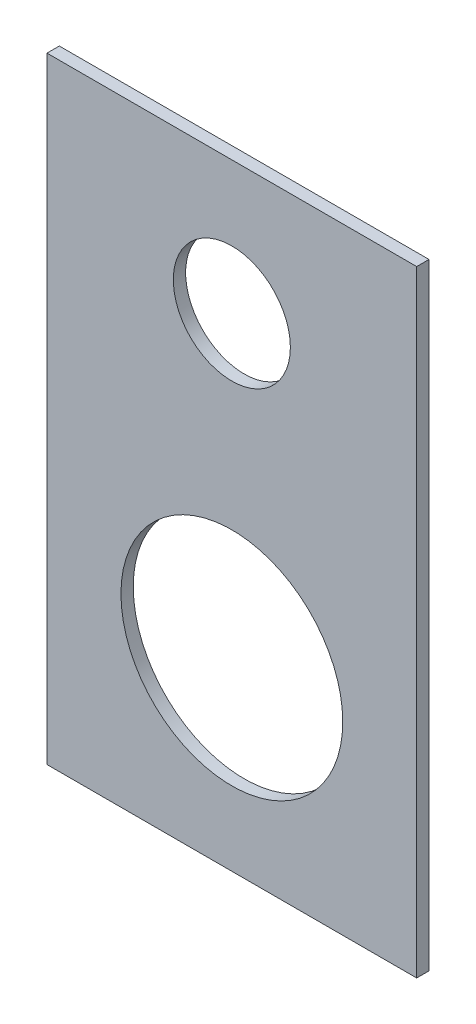
ISO-10303-21;
HEADER;
FILE_DESCRIPTION(('STEP AP214'),'2;1');
FILE_NAME('part.step','',(''),(''),'','','');
FILE_SCHEMA(('AUTOMOTIVE_DESIGN { 1 0 10303 214 1 1 1 1 }'));
ENDSEC;
DATA;
#1=APPLICATION_CONTEXT('core data for automotive mechanical design processes');
#2=APPLICATION_PROTOCOL_DEFINITION('international standard','automotive_design',2000,#1);
#3=PRODUCT_CONTEXT('',#1,'mechanical');
#4=PRODUCT('Part','Part','',(#3));
#5=PRODUCT_RELATED_PRODUCT_CATEGORY('part','',(#4));
#6=PRODUCT_DEFINITION_FORMATION('','',#4);
#7=PRODUCT_DEFINITION_CONTEXT('part definition',#1,'design');
#8=PRODUCT_DEFINITION('design','',#6,#7);
#9=PRODUCT_DEFINITION_SHAPE('','',#8);
#10=(LENGTH_UNIT() NAMED_UNIT(*) SI_UNIT(.MILLI.,.METRE.));
#11=(NAMED_UNIT(*) PLANE_ANGLE_UNIT() SI_UNIT($,.RADIAN.));
#12=(NAMED_UNIT(*) SI_UNIT($,.STERADIAN.) SOLID_ANGLE_UNIT());
#13=UNCERTAINTY_MEASURE_WITH_UNIT(LENGTH_MEASURE(1.E-05),#10,'distance_accuracy_value','');
#14=(GEOMETRIC_REPRESENTATION_CONTEXT(3) GLOBAL_UNCERTAINTY_ASSIGNED_CONTEXT((#13)) GLOBAL_UNIT_ASSIGNED_CONTEXT((#10,
#11,#12)) REPRESENTATION_CONTEXT('',''));
#15=CARTESIAN_POINT('',(0.,0.,0.));
#16=DIRECTION('',(0.,0.,1.));
#17=DIRECTION('',(1.,0.,0.));
#18=AXIS2_PLACEMENT_3D('',#15,#16,#17);
#19=CARTESIAN_POINT('',(0.,0.,-10.));
#20=DIRECTION('',(-1.,0.,0.));
#21=DIRECTION('',(0.,-1.,0.));
#22=AXIS2_PLACEMENT_3D('',#19,#20,#21);
#23=PLANE('',#22);
#24=DIRECTION('',(0.,-1.,0.));
#25=VECTOR('',#24,1.);
#26=CARTESIAN_POINT('',(0.,0.,0.));
#27=LINE('',#26,#25);
#28=CARTESIAN_POINT('',(-1.20207153456121E-13,500.,0.));
#29=VERTEX_POINT('',#28);
#30=CARTESIAN_POINT('',(0.,0.,0.));
#31=VERTEX_POINT('',#30);
#32=EDGE_CURVE('E96',#29,#31,#27,.T.);
#33=ORIENTED_EDGE('',*,*,#32,.F.);
#34=DIRECTION('',(0.,0.,1.));
#35=VECTOR('',#34,1.);
#36=CARTESIAN_POINT('',(-1.20207153456121E-13,500.,-10.));
#37=LINE('',#36,#35);
#38=CARTESIAN_POINT('',(-1.20207153456121E-13,500.,-10.));
#39=VERTEX_POINT('',#38);
#40=EDGE_CURVE('E11',#39,#29,#37,.T.);
#41=ORIENTED_EDGE('',*,*,#40,.F.);
#42=DIRECTION('',(0.,-1.,0.));
#43=VECTOR('',#42,1.);
#44=CARTESIAN_POINT('',(0.,0.,-10.));
#45=LINE('',#44,#43);
#46=CARTESIAN_POINT('',(0.,0.,-10.));
#47=VERTEX_POINT('',#46);
#48=EDGE_CURVE('E89',#39,#47,#45,.T.);
#49=ORIENTED_EDGE('',*,*,#48,.T.);
#50=DIRECTION('',(0.,0.,1.));
#51=VECTOR('',#50,1.);
#52=CARTESIAN_POINT('',(0.,0.,-10.));
#53=LINE('',#52,#51);
#54=EDGE_CURVE('E34',#47,#31,#53,.T.);
#55=ORIENTED_EDGE('',*,*,#54,.T.);
#56=EDGE_LOOP('',(#33,#41,#49,#55));
#57=FACE_BOUND('',#56,.T.);
#58=ADVANCED_FACE('F31',(#57),#23,.T.);
#59=CARTESIAN_POINT('',(-1.20207153456121E-13,500.,-10.));
#60=DIRECTION('',(0.,1.,0.));
#61=DIRECTION('',(0.,0.,1.));
#62=AXIS2_PLACEMENT_3D('',#59,#60,#61);
#63=PLANE('',#62);
#64=DIRECTION('',(-1.,0.,0.));
#65=VECTOR('',#64,1.);
#66=CARTESIAN_POINT('',(-1.20207153456121E-13,500.,0.));
#67=LINE('',#66,#65);
#68=CARTESIAN_POINT('',(300.,500.,0.));
#69=VERTEX_POINT('',#68);
#70=EDGE_CURVE('E91',#69,#29,#67,.T.);
#71=ORIENTED_EDGE('',*,*,#70,.F.);
#72=DIRECTION('',(0.,0.,1.));
#73=VECTOR('',#72,1.);
#74=CARTESIAN_POINT('',(300.,500.,-10.));
#75=LINE('',#74,#73);
#76=CARTESIAN_POINT('',(300.,500.,-10.));
#77=VERTEX_POINT('',#76);
#78=EDGE_CURVE('E40',#77,#69,#75,.T.);
#79=ORIENTED_EDGE('',*,*,#78,.F.);
#80=DIRECTION('',(-1.,0.,0.));
#81=VECTOR('',#80,1.);
#82=CARTESIAN_POINT('',(-1.20207153456121E-13,500.,-10.));
#83=LINE('',#82,#81);
#84=EDGE_CURVE('E86',#77,#39,#83,.T.);
#85=ORIENTED_EDGE('',*,*,#84,.T.);
#86=ORIENTED_EDGE('',*,*,#40,.T.);
#87=EDGE_LOOP('',(#71,#79,#85,#86));
#88=FACE_BOUND('',#87,.T.);
#89=ADVANCED_FACE('F107',(#88),#63,.T.);
#90=CARTESIAN_POINT('',(300.,0.,-10.));
#91=DIRECTION('',(1.,0.,0.));
#92=DIRECTION('',(0.,1.,0.));
#93=AXIS2_PLACEMENT_3D('',#90,#91,#92);
#94=PLANE('',#93);
#95=DIRECTION('',(0.,1.,0.));
#96=VECTOR('',#95,1.);
#97=CARTESIAN_POINT('',(300.,0.,0.));
#98=LINE('',#97,#96);
#99=CARTESIAN_POINT('',(300.,0.,0.));
#100=VERTEX_POINT('',#99);
#101=EDGE_CURVE('E81',#100,#69,#98,.T.);
#102=ORIENTED_EDGE('',*,*,#101,.F.);
#103=DIRECTION('',(0.,0.,1.));
#104=VECTOR('',#103,1.);
#105=CARTESIAN_POINT('',(300.,0.,-10.));
#106=LINE('',#105,#104);
#107=CARTESIAN_POINT('',(300.,0.,-10.));
#108=VERTEX_POINT('',#107);
#109=EDGE_CURVE('E76',#108,#100,#106,.T.);
#110=ORIENTED_EDGE('',*,*,#109,.F.);
#111=DIRECTION('',(0.,1.,0.));
#112=VECTOR('',#111,1.);
#113=CARTESIAN_POINT('',(300.,0.,-10.));
#114=LINE('',#113,#112);
#115=EDGE_CURVE('E79',#108,#77,#114,.T.);
#116=ORIENTED_EDGE('',*,*,#115,.T.);
#117=ORIENTED_EDGE('',*,*,#78,.T.);
#118=EDGE_LOOP('',(#102,#110,#116,#117));
#119=FACE_BOUND('',#118,.T.);
#120=ADVANCED_FACE('F78',(#119),#94,.T.);
#121=CARTESIAN_POINT('',(0.,0.,-10.));
#122=DIRECTION('',(0.,-1.,0.));
#123=DIRECTION('',(0.,0.,-1.));
#124=AXIS2_PLACEMENT_3D('',#121,#122,#123);
#125=PLANE('',#124);
#126=DIRECTION('',(1.,0.,0.));
#127=VECTOR('',#126,1.);
#128=CARTESIAN_POINT('',(0.,0.,0.));
#129=LINE('',#128,#127);
#130=EDGE_CURVE('E99',#31,#100,#129,.T.);
#131=ORIENTED_EDGE('',*,*,#130,.F.);
#132=ORIENTED_EDGE('',*,*,#54,.F.);
#133=DIRECTION('',(1.,0.,0.));
#134=VECTOR('',#133,1.);
#135=CARTESIAN_POINT('',(0.,0.,-10.));
#136=LINE('',#135,#134);
#137=EDGE_CURVE('E85',#47,#108,#136,.T.);
#138=ORIENTED_EDGE('',*,*,#137,.T.);
#139=ORIENTED_EDGE('',*,*,#109,.T.);
#140=EDGE_LOOP('',(#131,#132,#138,#139));
#141=FACE_BOUND('',#140,.T.);
#142=ADVANCED_FACE('F88',(#141),#125,.T.);
#143=CARTESIAN_POINT('',(-1.20207153456121E-13,500.,-10.));
#144=DIRECTION('',(0.,0.,-1.));
#145=DIRECTION('',(-1.,0.,0.));
#146=AXIS2_PLACEMENT_3D('',#143,#144,#145);
#147=PLANE('',#146);
#148=CARTESIAN_POINT('',(150.,392.,-10.));
#149=DIRECTION('',(0.,0.,1.));
#150=DIRECTION('',(1.,0.,0.));
#151=AXIS2_PLACEMENT_3D('',#148,#149,#150);
#152=CIRCLE('',#151,47.5);
#153=CARTESIAN_POINT('',(197.5,392.,-10.));
#154=VERTEX_POINT('',#153);
#155=EDGE_CURVE('E140',#154,#154,#152,.T.);
#156=ORIENTED_EDGE('',*,*,#155,.T.);
#157=EDGE_LOOP('',(#156));
#158=FACE_BOUND('',#157,.T.);
#159=CARTESIAN_POINT('',(150.,150.,-10.));
#160=DIRECTION('',(0.,0.,1.));
#161=DIRECTION('',(1.,0.,0.));
#162=AXIS2_PLACEMENT_3D('',#159,#160,#161);
#163=CIRCLE('',#162,90.);
#164=CARTESIAN_POINT('',(240.,150.,-10.));
#165=VERTEX_POINT('',#164);
#166=EDGE_CURVE('E100',#165,#165,#163,.T.);
#167=ORIENTED_EDGE('',*,*,#166,.T.);
#168=EDGE_LOOP('',(#167));
#169=FACE_BOUND('',#168,.T.);
#170=ORIENTED_EDGE('',*,*,#48,.F.);
#171=ORIENTED_EDGE('',*,*,#84,.F.);
#172=ORIENTED_EDGE('',*,*,#115,.F.);
#173=ORIENTED_EDGE('',*,*,#137,.F.);
#174=EDGE_LOOP('',(#170,#171,#172,#173));
#175=FACE_BOUND('',#174,.T.);
#176=ADVANCED_FACE('F84',(#158,#169,#175),#147,.T.);
#177=CARTESIAN_POINT('',(-1.20207153456121E-13,500.,0.));
#178=DIRECTION('',(0.,0.,-1.));
#179=DIRECTION('',(-1.,0.,0.));
#180=AXIS2_PLACEMENT_3D('',#177,#178,#179);
#181=PLANE('',#180);
#182=CARTESIAN_POINT('',(150.,392.,0.));
#183=DIRECTION('',(0.,0.,1.));
#184=DIRECTION('',(1.,0.,0.));
#185=AXIS2_PLACEMENT_3D('',#182,#183,#184);
#186=CIRCLE('',#185,47.5);
#187=CARTESIAN_POINT('',(197.5,392.,0.));
#188=VERTEX_POINT('',#187);
#189=EDGE_CURVE('E143',#188,#188,#186,.T.);
#190=ORIENTED_EDGE('',*,*,#189,.F.);
#191=EDGE_LOOP('',(#190));
#192=FACE_BOUND('',#191,.T.);
#193=CARTESIAN_POINT('',(150.,150.,0.));
#194=DIRECTION('',(0.,0.,1.));
#195=DIRECTION('',(1.,0.,0.));
#196=AXIS2_PLACEMENT_3D('',#193,#194,#195);
#197=CIRCLE('',#196,90.);
#198=CARTESIAN_POINT('',(240.,150.,0.));
#199=VERTEX_POINT('',#198);
#200=EDGE_CURVE('E145',#199,#199,#197,.T.);
#201=ORIENTED_EDGE('',*,*,#200,.F.);
#202=EDGE_LOOP('',(#201));
#203=FACE_BOUND('',#202,.T.);
#204=ORIENTED_EDGE('',*,*,#32,.T.);
#205=ORIENTED_EDGE('',*,*,#130,.T.);
#206=ORIENTED_EDGE('',*,*,#101,.T.);
#207=ORIENTED_EDGE('',*,*,#70,.T.);
#208=EDGE_LOOP('',(#204,#205,#206,#207));
#209=FACE_BOUND('',#208,.T.);
#210=ADVANCED_FACE('F106',(#192,#203,#209),#181,.F.);
#211=CARTESIAN_POINT('',(150.,150.,-10.));
#212=DIRECTION('',(0.,0.,1.));
#213=DIRECTION('',(1.,0.,0.));
#214=AXIS2_PLACEMENT_3D('',#211,#212,#213);
#215=CYLINDRICAL_SURFACE('',#214,90.);
#216=ORIENTED_EDGE('',*,*,#166,.F.);
#217=EDGE_LOOP('',(#216));
#218=FACE_BOUND('',#217,.T.);
#219=ORIENTED_EDGE('',*,*,#200,.T.);
#220=EDGE_LOOP('',(#219));
#221=FACE_BOUND('',#220,.T.);
#222=ADVANCED_FACE('F125',(#218,#221),#215,.F.);
#223=CARTESIAN_POINT('',(150.,392.,-10.));
#224=DIRECTION('',(0.,0.,1.));
#225=DIRECTION('',(1.,0.,0.));
#226=AXIS2_PLACEMENT_3D('',#223,#224,#225);
#227=CYLINDRICAL_SURFACE('',#226,47.5);
#228=ORIENTED_EDGE('',*,*,#155,.F.);
#229=EDGE_LOOP('',(#228));
#230=FACE_BOUND('',#229,.T.);
#231=ORIENTED_EDGE('',*,*,#189,.T.);
#232=EDGE_LOOP('',(#231));
#233=FACE_BOUND('',#232,.T.);
#234=ADVANCED_FACE('F132',(#230,#233),#227,.F.);
#235=CLOSED_SHELL('',(#58,#89,#120,#142,#176,#210,#222,#234));
#236=MANIFOLD_SOLID_BREP('B2',#235);
#237=ADVANCED_BREP_SHAPE_REPRESENTATION('',(#18,#236),#14);
#238=SHAPE_DEFINITION_REPRESENTATION(#9,#237);
ENDSEC;
END-ISO-10303-21;
